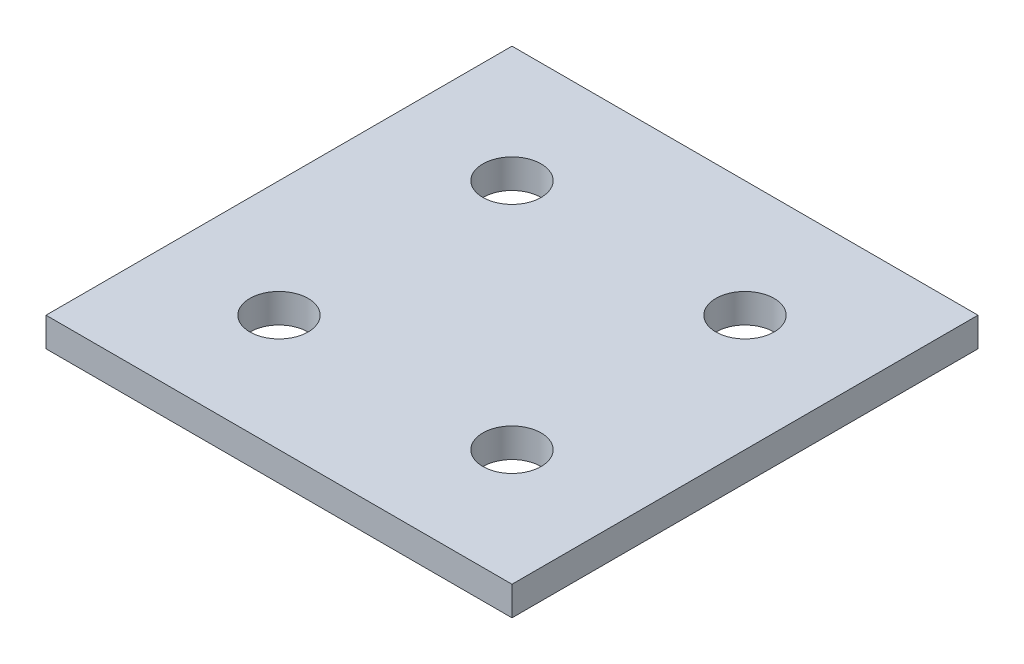
ISO-10303-21;
HEADER;
FILE_DESCRIPTION(('STEP AP214'),'2;1');
FILE_NAME('part.step','',(''),(''),'','','');
FILE_SCHEMA(('AUTOMOTIVE_DESIGN { 1 0 10303 214 1 1 1 1 }'));
ENDSEC;
DATA;
#1=APPLICATION_CONTEXT('core data for automotive mechanical design processes');
#2=APPLICATION_PROTOCOL_DEFINITION('international standard','automotive_design',2000,#1);
#3=PRODUCT_CONTEXT('',#1,'mechanical');
#4=PRODUCT('Part','Part','',(#3));
#5=PRODUCT_RELATED_PRODUCT_CATEGORY('part','',(#4));
#6=PRODUCT_DEFINITION_FORMATION('','',#4);
#7=PRODUCT_DEFINITION_CONTEXT('part definition',#1,'design');
#8=PRODUCT_DEFINITION('design','',#6,#7);
#9=PRODUCT_DEFINITION_SHAPE('','',#8);
#10=(LENGTH_UNIT() NAMED_UNIT(*) SI_UNIT(.MILLI.,.METRE.));
#11=(NAMED_UNIT(*) PLANE_ANGLE_UNIT() SI_UNIT($,.RADIAN.));
#12=(NAMED_UNIT(*) SI_UNIT($,.STERADIAN.) SOLID_ANGLE_UNIT());
#13=UNCERTAINTY_MEASURE_WITH_UNIT(LENGTH_MEASURE(1.E-05),#10,'distance_accuracy_value','');
#14=(GEOMETRIC_REPRESENTATION_CONTEXT(3) GLOBAL_UNCERTAINTY_ASSIGNED_CONTEXT((#13)) GLOBAL_UNIT_ASSIGNED_CONTEXT((#10,
#11,#12)) REPRESENTATION_CONTEXT('',''));
#15=CARTESIAN_POINT('',(0.,0.,0.));
#16=DIRECTION('',(0.,0.,1.));
#17=DIRECTION('',(1.,0.,0.));
#18=AXIS2_PLACEMENT_3D('',#15,#16,#17);
#19=CARTESIAN_POINT('',(0.,6.35,0.));
#20=DIRECTION('',(1.,0.,0.));
#21=DIRECTION('',(0.,0.,-1.));
#22=AXIS2_PLACEMENT_3D('',#19,#20,#21);
#23=PLANE('',#22);
#24=DIRECTION('',(0.,0.,1.));
#25=VECTOR('',#24,1.);
#26=CARTESIAN_POINT('',(0.,0.,0.));
#27=LINE('',#26,#25);
#28=CARTESIAN_POINT('',(0.,0.,-101.6));
#29=VERTEX_POINT('',#28);
#30=CARTESIAN_POINT('',(0.,0.,0.));
#31=VERTEX_POINT('',#30);
#32=EDGE_CURVE('E107',#29,#31,#27,.T.);
#33=ORIENTED_EDGE('',*,*,#32,.T.);
#34=DIRECTION('',(0.,-1.,0.));
#35=VECTOR('',#34,1.);
#36=CARTESIAN_POINT('',(0.,6.35,0.));
#37=LINE('',#36,#35);
#38=CARTESIAN_POINT('',(0.,6.35,0.));
#39=VERTEX_POINT('',#38);
#40=EDGE_CURVE('E11',#39,#31,#37,.T.);
#41=ORIENTED_EDGE('',*,*,#40,.F.);
#42=DIRECTION('',(0.,0.,1.));
#43=VECTOR('',#42,1.);
#44=CARTESIAN_POINT('',(0.,6.35,0.));
#45=LINE('',#44,#43);
#46=CARTESIAN_POINT('',(0.,6.35,-101.6));
#47=VERTEX_POINT('',#46);
#48=EDGE_CURVE('E91',#47,#39,#45,.T.);
#49=ORIENTED_EDGE('',*,*,#48,.F.);
#50=DIRECTION('',(0.,-1.,0.));
#51=VECTOR('',#50,1.);
#52=CARTESIAN_POINT('',(0.,6.35,-101.6));
#53=LINE('',#52,#51);
#54=EDGE_CURVE('E103',#47,#29,#53,.T.);
#55=ORIENTED_EDGE('',*,*,#54,.T.);
#56=EDGE_LOOP('',(#33,#41,#49,#55));
#57=FACE_BOUND('',#56,.T.);
#58=ADVANCED_FACE('F39',(#57),#23,.F.);
#59=CARTESIAN_POINT('',(0.,6.35,0.));
#60=DIRECTION('',(0.,0.,-1.));
#61=DIRECTION('',(-1.,0.,0.));
#62=AXIS2_PLACEMENT_3D('',#59,#60,#61);
#63=PLANE('',#62);
#64=DIRECTION('',(1.,0.,0.));
#65=VECTOR('',#64,1.);
#66=CARTESIAN_POINT('',(0.,0.,0.));
#67=LINE('',#66,#65);
#68=CARTESIAN_POINT('',(101.6,0.,0.));
#69=VERTEX_POINT('',#68);
#70=EDGE_CURVE('E96',#31,#69,#67,.T.);
#71=ORIENTED_EDGE('',*,*,#70,.T.);
#72=DIRECTION('',(0.,-1.,0.));
#73=VECTOR('',#72,1.);
#74=CARTESIAN_POINT('',(101.6,6.35,0.));
#75=LINE('',#74,#73);
#76=CARTESIAN_POINT('',(101.6,6.35,0.));
#77=VERTEX_POINT('',#76);
#78=EDGE_CURVE('E48',#77,#69,#75,.T.);
#79=ORIENTED_EDGE('',*,*,#78,.F.);
#80=DIRECTION('',(1.,0.,0.));
#81=VECTOR('',#80,1.);
#82=CARTESIAN_POINT('',(0.,6.35,0.));
#83=LINE('',#82,#81);
#84=EDGE_CURVE('E86',#39,#77,#83,.T.);
#85=ORIENTED_EDGE('',*,*,#84,.F.);
#86=ORIENTED_EDGE('',*,*,#40,.T.);
#87=EDGE_LOOP('',(#71,#79,#85,#86));
#88=FACE_BOUND('',#87,.T.);
#89=ADVANCED_FACE('F95',(#88),#63,.F.);
#90=CARTESIAN_POINT('',(101.6,6.35,0.));
#91=DIRECTION('',(-1.,0.,0.));
#92=DIRECTION('',(0.,0.,1.));
#93=AXIS2_PLACEMENT_3D('',#90,#91,#92);
#94=PLANE('',#93);
#95=DIRECTION('',(0.,0.,-1.));
#96=VECTOR('',#95,1.);
#97=CARTESIAN_POINT('',(101.6,0.,0.));
#98=LINE('',#97,#96);
#99=CARTESIAN_POINT('',(101.6,0.,-101.6));
#100=VERTEX_POINT('',#99);
#101=EDGE_CURVE('E73',#69,#100,#98,.T.);
#102=ORIENTED_EDGE('',*,*,#101,.T.);
#103=DIRECTION('',(0.,-1.,0.));
#104=VECTOR('',#103,1.);
#105=CARTESIAN_POINT('',(101.6,6.35,-101.6));
#106=LINE('',#105,#104);
#107=CARTESIAN_POINT('',(101.6,6.35,-101.6));
#108=VERTEX_POINT('',#107);
#109=EDGE_CURVE('E98',#108,#100,#106,.T.);
#110=ORIENTED_EDGE('',*,*,#109,.F.);
#111=DIRECTION('',(0.,0.,-1.));
#112=VECTOR('',#111,1.);
#113=CARTESIAN_POINT('',(101.6,6.35,0.));
#114=LINE('',#113,#112);
#115=EDGE_CURVE('E89',#77,#108,#114,.T.);
#116=ORIENTED_EDGE('',*,*,#115,.F.);
#117=ORIENTED_EDGE('',*,*,#78,.T.);
#118=EDGE_LOOP('',(#102,#110,#116,#117));
#119=FACE_BOUND('',#118,.T.);
#120=ADVANCED_FACE('F99',(#119),#94,.F.);
#121=CARTESIAN_POINT('',(0.,6.35,-101.6));
#122=DIRECTION('',(0.,0.,1.));
#123=DIRECTION('',(1.,0.,0.));
#124=AXIS2_PLACEMENT_3D('',#121,#122,#123);
#125=PLANE('',#124);
#126=DIRECTION('',(-1.,0.,0.));
#127=VECTOR('',#126,1.);
#128=CARTESIAN_POINT('',(0.,0.,-101.6));
#129=LINE('',#128,#127);
#130=EDGE_CURVE('E79',#100,#29,#129,.T.);
#131=ORIENTED_EDGE('',*,*,#130,.T.);
#132=ORIENTED_EDGE('',*,*,#54,.F.);
#133=DIRECTION('',(-1.,0.,0.));
#134=VECTOR('',#133,1.);
#135=CARTESIAN_POINT('',(0.,6.35,-101.6));
#136=LINE('',#135,#134);
#137=EDGE_CURVE('E56',#108,#47,#136,.T.);
#138=ORIENTED_EDGE('',*,*,#137,.F.);
#139=ORIENTED_EDGE('',*,*,#109,.T.);
#140=EDGE_LOOP('',(#131,#132,#138,#139));
#141=FACE_BOUND('',#140,.T.);
#142=ADVANCED_FACE('F121',(#141),#125,.F.);
#143=CARTESIAN_POINT('',(0.,6.35,0.));
#144=DIRECTION('',(0.,-1.,0.));
#145=DIRECTION('',(0.,0.,-1.));
#146=AXIS2_PLACEMENT_3D('',#143,#144,#145);
#147=PLANE('',#146);
#148=CARTESIAN_POINT('',(25.4,6.35,-25.4));
#149=DIRECTION('',(0.,1.,0.));
#150=DIRECTION('',(0.,0.,1.));
#151=AXIS2_PLACEMENT_3D('',#148,#149,#150);
#152=CIRCLE('',#151,6.35);
#153=CARTESIAN_POINT('',(25.4,6.35,-19.05));
#154=VERTEX_POINT('',#153);
#155=EDGE_CURVE('E155',#154,#154,#152,.T.);
#156=ORIENTED_EDGE('',*,*,#155,.F.);
#157=EDGE_LOOP('',(#156));
#158=FACE_BOUND('',#157,.T.);
#159=CARTESIAN_POINT('',(25.4,6.35,-76.2));
#160=DIRECTION('',(0.,1.,0.));
#161=DIRECTION('',(0.,0.,1.));
#162=AXIS2_PLACEMENT_3D('',#159,#160,#161);
#163=CIRCLE('',#162,6.35);
#164=CARTESIAN_POINT('',(25.4,6.35,-69.85));
#165=VERTEX_POINT('',#164);
#166=EDGE_CURVE('E147',#165,#165,#163,.T.);
#167=ORIENTED_EDGE('',*,*,#166,.F.);
#168=EDGE_LOOP('',(#167));
#169=FACE_BOUND('',#168,.T.);
#170=CARTESIAN_POINT('',(76.2,6.35,-76.2));
#171=DIRECTION('',(0.,1.,0.));
#172=DIRECTION('',(0.,0.,1.));
#173=AXIS2_PLACEMENT_3D('',#170,#171,#172);
#174=CIRCLE('',#173,6.34999999999999);
#175=CARTESIAN_POINT('',(76.2,6.35,-69.85));
#176=VERTEX_POINT('',#175);
#177=EDGE_CURVE('E139',#176,#176,#174,.T.);
#178=ORIENTED_EDGE('',*,*,#177,.F.);
#179=EDGE_LOOP('',(#178));
#180=FACE_BOUND('',#179,.T.);
#181=CARTESIAN_POINT('',(76.2,6.35,-25.4));
#182=DIRECTION('',(0.,1.,0.));
#183=DIRECTION('',(0.,0.,1.));
#184=AXIS2_PLACEMENT_3D('',#181,#182,#183);
#185=CIRCLE('',#184,6.34999999999999);
#186=CARTESIAN_POINT('',(76.2,6.35,-19.05));
#187=VERTEX_POINT('',#186);
#188=EDGE_CURVE('E131',#187,#187,#185,.T.);
#189=ORIENTED_EDGE('',*,*,#188,.F.);
#190=EDGE_LOOP('',(#189));
#191=FACE_BOUND('',#190,.T.);
#192=ORIENTED_EDGE('',*,*,#48,.T.);
#193=ORIENTED_EDGE('',*,*,#84,.T.);
#194=ORIENTED_EDGE('',*,*,#115,.T.);
#195=ORIENTED_EDGE('',*,*,#137,.T.);
#196=EDGE_LOOP('',(#192,#193,#194,#195));
#197=FACE_BOUND('',#196,.T.);
#198=ADVANCED_FACE('F87',(#158,#169,#180,#191,#197),#147,.F.);
#199=CARTESIAN_POINT('',(0.,0.,0.));
#200=DIRECTION('',(0.,-1.,0.));
#201=DIRECTION('',(0.,0.,-1.));
#202=AXIS2_PLACEMENT_3D('',#199,#200,#201);
#203=PLANE('',#202);
#204=CARTESIAN_POINT('',(25.4,0.,-25.4));
#205=DIRECTION('',(0.,1.,0.));
#206=DIRECTION('',(0.,0.,1.));
#207=AXIS2_PLACEMENT_3D('',#204,#205,#206);
#208=CIRCLE('',#207,6.35);
#209=CARTESIAN_POINT('',(25.4,0.,-19.05));
#210=VERTEX_POINT('',#209);
#211=EDGE_CURVE('E151',#210,#210,#208,.T.);
#212=ORIENTED_EDGE('',*,*,#211,.T.);
#213=EDGE_LOOP('',(#212));
#214=FACE_BOUND('',#213,.T.);
#215=CARTESIAN_POINT('',(25.4,0.,-76.2));
#216=DIRECTION('',(0.,1.,0.));
#217=DIRECTION('',(0.,0.,1.));
#218=AXIS2_PLACEMENT_3D('',#215,#216,#217);
#219=CIRCLE('',#218,6.35);
#220=CARTESIAN_POINT('',(25.4,0.,-69.85));
#221=VERTEX_POINT('',#220);
#222=EDGE_CURVE('E143',#221,#221,#219,.T.);
#223=ORIENTED_EDGE('',*,*,#222,.T.);
#224=EDGE_LOOP('',(#223));
#225=FACE_BOUND('',#224,.T.);
#226=CARTESIAN_POINT('',(76.2,0.,-76.2));
#227=DIRECTION('',(0.,1.,0.));
#228=DIRECTION('',(0.,0.,1.));
#229=AXIS2_PLACEMENT_3D('',#226,#227,#228);
#230=CIRCLE('',#229,6.34999999999999);
#231=CARTESIAN_POINT('',(76.2,0.,-69.85));
#232=VERTEX_POINT('',#231);
#233=EDGE_CURVE('E135',#232,#232,#230,.T.);
#234=ORIENTED_EDGE('',*,*,#233,.T.);
#235=EDGE_LOOP('',(#234));
#236=FACE_BOUND('',#235,.T.);
#237=CARTESIAN_POINT('',(76.2,0.,-25.4));
#238=DIRECTION('',(0.,1.,0.));
#239=DIRECTION('',(0.,0.,1.));
#240=AXIS2_PLACEMENT_3D('',#237,#238,#239);
#241=CIRCLE('',#240,6.34999999999999);
#242=CARTESIAN_POINT('',(76.2,0.,-19.05));
#243=VERTEX_POINT('',#242);
#244=EDGE_CURVE('E111',#243,#243,#241,.T.);
#245=ORIENTED_EDGE('',*,*,#244,.T.);
#246=EDGE_LOOP('',(#245));
#247=FACE_BOUND('',#246,.T.);
#248=ORIENTED_EDGE('',*,*,#32,.F.);
#249=ORIENTED_EDGE('',*,*,#130,.F.);
#250=ORIENTED_EDGE('',*,*,#101,.F.);
#251=ORIENTED_EDGE('',*,*,#70,.F.);
#252=EDGE_LOOP('',(#248,#249,#250,#251));
#253=FACE_BOUND('',#252,.T.);
#254=ADVANCED_FACE('F124',(#214,#225,#236,#247,#253),#203,.T.);
#255=CARTESIAN_POINT('',(76.2,6.35,-25.4));
#256=DIRECTION('',(0.,1.,0.));
#257=DIRECTION('',(0.,0.,1.));
#258=AXIS2_PLACEMENT_3D('',#255,#256,#257);
#259=CYLINDRICAL_SURFACE('',#258,6.34999999999999);
#260=ORIENTED_EDGE('',*,*,#244,.F.);
#261=EDGE_LOOP('',(#260));
#262=FACE_BOUND('',#261,.T.);
#263=ORIENTED_EDGE('',*,*,#188,.T.);
#264=EDGE_LOOP('',(#263));
#265=FACE_BOUND('',#264,.T.);
#266=ADVANCED_FACE('F171',(#262,#265),#259,.F.);
#267=CARTESIAN_POINT('',(76.2,6.35,-76.2));
#268=DIRECTION('',(0.,1.,0.));
#269=DIRECTION('',(0.,0.,1.));
#270=AXIS2_PLACEMENT_3D('',#267,#268,#269);
#271=CYLINDRICAL_SURFACE('',#270,6.34999999999999);
#272=ORIENTED_EDGE('',*,*,#233,.F.);
#273=EDGE_LOOP('',(#272));
#274=FACE_BOUND('',#273,.T.);
#275=ORIENTED_EDGE('',*,*,#177,.T.);
#276=EDGE_LOOP('',(#275));
#277=FACE_BOUND('',#276,.T.);
#278=ADVANCED_FACE('F173',(#274,#277),#271,.F.);
#279=CARTESIAN_POINT('',(25.4,6.35,-76.2));
#280=DIRECTION('',(0.,1.,0.));
#281=DIRECTION('',(0.,0.,1.));
#282=AXIS2_PLACEMENT_3D('',#279,#280,#281);
#283=CYLINDRICAL_SURFACE('',#282,6.35);
#284=ORIENTED_EDGE('',*,*,#222,.F.);
#285=EDGE_LOOP('',(#284));
#286=FACE_BOUND('',#285,.T.);
#287=ORIENTED_EDGE('',*,*,#166,.T.);
#288=EDGE_LOOP('',(#287));
#289=FACE_BOUND('',#288,.T.);
#290=ADVANCED_FACE('F180',(#286,#289),#283,.F.);
#291=CARTESIAN_POINT('',(25.4,6.35,-25.4));
#292=DIRECTION('',(0.,1.,0.));
#293=DIRECTION('',(0.,0.,1.));
#294=AXIS2_PLACEMENT_3D('',#291,#292,#293);
#295=CYLINDRICAL_SURFACE('',#294,6.35);
#296=ORIENTED_EDGE('',*,*,#211,.F.);
#297=EDGE_LOOP('',(#296));
#298=FACE_BOUND('',#297,.T.);
#299=ORIENTED_EDGE('',*,*,#155,.T.);
#300=EDGE_LOOP('',(#299));
#301=FACE_BOUND('',#300,.T.);
#302=ADVANCED_FACE('F160',(#298,#301),#295,.F.);
#303=CLOSED_SHELL('',(#58,#89,#120,#142,#198,#254,#266,#278,#290,#302));
#304=MANIFOLD_SOLID_BREP('B2',#303);
#305=ADVANCED_BREP_SHAPE_REPRESENTATION('',(#18,#304),#14);
#306=SHAPE_DEFINITION_REPRESENTATION(#9,#305);
ENDSEC;
END-ISO-10303-21;
